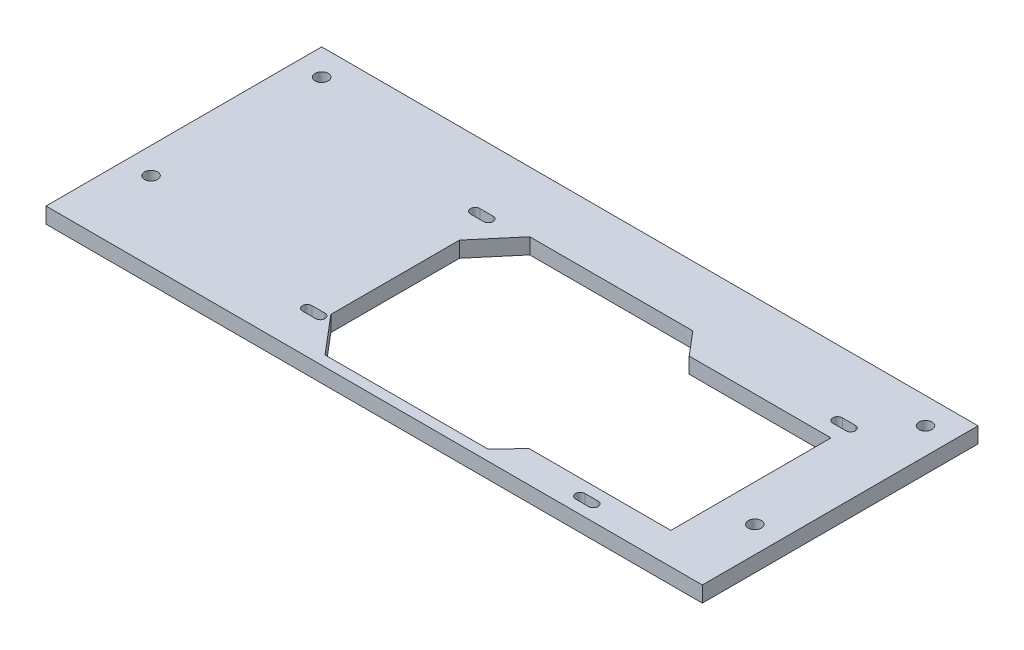
ISO-10303-21;
HEADER;
FILE_DESCRIPTION(('STEP AP214'),'2;1');
FILE_NAME('part.step','',(''),(''),'','','');
FILE_SCHEMA(('AUTOMOTIVE_DESIGN { 1 0 10303 214 1 1 1 1 }'));
ENDSEC;
DATA;
#1=APPLICATION_CONTEXT('core data for automotive mechanical design processes');
#2=APPLICATION_PROTOCOL_DEFINITION('international standard','automotive_design',2000,#1);
#3=PRODUCT_CONTEXT('',#1,'mechanical');
#4=PRODUCT('Part','Part','',(#3));
#5=PRODUCT_RELATED_PRODUCT_CATEGORY('part','',(#4));
#6=PRODUCT_DEFINITION_FORMATION('','',#4);
#7=PRODUCT_DEFINITION_CONTEXT('part definition',#1,'design');
#8=PRODUCT_DEFINITION('design','',#6,#7);
#9=PRODUCT_DEFINITION_SHAPE('','',#8);
#10=(LENGTH_UNIT() NAMED_UNIT(*) SI_UNIT(.MILLI.,.METRE.));
#11=(NAMED_UNIT(*) PLANE_ANGLE_UNIT() SI_UNIT($,.RADIAN.));
#12=(NAMED_UNIT(*) SI_UNIT($,.STERADIAN.) SOLID_ANGLE_UNIT());
#13=UNCERTAINTY_MEASURE_WITH_UNIT(LENGTH_MEASURE(1.E-05),#10,'distance_accuracy_value','');
#14=(GEOMETRIC_REPRESENTATION_CONTEXT(3) GLOBAL_UNCERTAINTY_ASSIGNED_CONTEXT((#13)) GLOBAL_UNIT_ASSIGNED_CONTEXT((#10,
#11,#12)) REPRESENTATION_CONTEXT('',''));
#15=CARTESIAN_POINT('',(0.,0.,0.));
#16=DIRECTION('',(0.,0.,1.));
#17=DIRECTION('',(1.,0.,0.));
#18=AXIS2_PLACEMENT_3D('',#15,#16,#17);
#19=CARTESIAN_POINT('',(-125.,6.,52.5));
#20=DIRECTION('',(-1.,0.,0.));
#21=DIRECTION('',(0.,0.,1.));
#22=AXIS2_PLACEMENT_3D('',#19,#20,#21);
#23=PLANE('',#22);
#24=DIRECTION('',(0.,0.,-1.));
#25=VECTOR('',#24,1.);
#26=CARTESIAN_POINT('',(-125.,0.,52.5));
#27=LINE('',#26,#25);
#28=CARTESIAN_POINT('',(-125.,0.,52.5));
#29=VERTEX_POINT('',#28);
#30=CARTESIAN_POINT('',(-125.,0.,-52.5));
#31=VERTEX_POINT('',#30);
#32=EDGE_CURVE('E626',#29,#31,#27,.T.);
#33=ORIENTED_EDGE('',*,*,#32,.F.);
#34=DIRECTION('',(0.,-1.,0.));
#35=VECTOR('',#34,1.);
#36=CARTESIAN_POINT('',(-125.,6.,52.5));
#37=LINE('',#36,#35);
#38=CARTESIAN_POINT('',(-125.,6.,52.5));
#39=VERTEX_POINT('',#38);
#40=EDGE_CURVE('E12',#39,#29,#37,.T.);
#41=ORIENTED_EDGE('',*,*,#40,.F.);
#42=DIRECTION('',(0.,0.,-1.));
#43=VECTOR('',#42,1.);
#44=CARTESIAN_POINT('',(-125.,6.,52.5));
#45=LINE('',#44,#43);
#46=CARTESIAN_POINT('',(-125.,6.,-52.5));
#47=VERTEX_POINT('',#46);
#48=EDGE_CURVE('E629',#39,#47,#45,.T.);
#49=ORIENTED_EDGE('',*,*,#48,.T.);
#50=DIRECTION('',(0.,-1.,0.));
#51=VECTOR('',#50,1.);
#52=CARTESIAN_POINT('',(-125.,6.,-52.5));
#53=LINE('',#52,#51);
#54=EDGE_CURVE('E203',#47,#31,#53,.T.);
#55=ORIENTED_EDGE('',*,*,#54,.T.);
#56=EDGE_LOOP('',(#33,#41,#49,#55));
#57=FACE_BOUND('',#56,.T.);
#58=ADVANCED_FACE('F200',(#57),#23,.T.);
#59=CARTESIAN_POINT('',(-125.,6.,52.5));
#60=DIRECTION('',(0.,0.,-1.));
#61=DIRECTION('',(-1.,0.,0.));
#62=AXIS2_PLACEMENT_3D('',#59,#60,#61);
#63=PLANE('',#62);
#64=DIRECTION('',(1.,0.,0.));
#65=VECTOR('',#64,1.);
#66=CARTESIAN_POINT('',(-125.,0.,52.5));
#67=LINE('',#66,#65);
#68=CARTESIAN_POINT('',(125.,0.,52.5));
#69=VERTEX_POINT('',#68);
#70=EDGE_CURVE('E633',#29,#69,#67,.T.);
#71=ORIENTED_EDGE('',*,*,#70,.T.);
#72=DIRECTION('',(0.,-1.,0.));
#73=VECTOR('',#72,1.);
#74=CARTESIAN_POINT('',(125.,6.,52.5));
#75=LINE('',#74,#73);
#76=CARTESIAN_POINT('',(125.,6.,52.5));
#77=VERTEX_POINT('',#76);
#78=EDGE_CURVE('E208',#77,#69,#75,.T.);
#79=ORIENTED_EDGE('',*,*,#78,.F.);
#80=DIRECTION('',(1.,0.,0.));
#81=VECTOR('',#80,1.);
#82=CARTESIAN_POINT('',(-125.,6.,52.5));
#83=LINE('',#82,#81);
#84=EDGE_CURVE('E638',#39,#77,#83,.T.);
#85=ORIENTED_EDGE('',*,*,#84,.F.);
#86=ORIENTED_EDGE('',*,*,#40,.T.);
#87=EDGE_LOOP('',(#71,#79,#85,#86));
#88=FACE_BOUND('',#87,.T.);
#89=ADVANCED_FACE('F664',(#88),#63,.F.);
#90=CARTESIAN_POINT('',(125.,6.,52.5));
#91=DIRECTION('',(-1.,0.,0.));
#92=DIRECTION('',(0.,0.,1.));
#93=AXIS2_PLACEMENT_3D('',#90,#91,#92);
#94=PLANE('',#93);
#95=DIRECTION('',(0.,0.,-1.));
#96=VECTOR('',#95,1.);
#97=CARTESIAN_POINT('',(125.,0.,52.5));
#98=LINE('',#97,#96);
#99=CARTESIAN_POINT('',(125.,0.,-52.5));
#100=VERTEX_POINT('',#99);
#101=EDGE_CURVE('E645',#69,#100,#98,.T.);
#102=ORIENTED_EDGE('',*,*,#101,.T.);
#103=DIRECTION('',(0.,-1.,0.));
#104=VECTOR('',#103,1.);
#105=CARTESIAN_POINT('',(125.,6.,-52.5));
#106=LINE('',#105,#104);
#107=CARTESIAN_POINT('',(125.,6.,-52.5));
#108=VERTEX_POINT('',#107);
#109=EDGE_CURVE('E650',#108,#100,#106,.T.);
#110=ORIENTED_EDGE('',*,*,#109,.F.);
#111=DIRECTION('',(0.,0.,-1.));
#112=VECTOR('',#111,1.);
#113=CARTESIAN_POINT('',(125.,6.,52.5));
#114=LINE('',#113,#112);
#115=EDGE_CURVE('E636',#77,#108,#114,.T.);
#116=ORIENTED_EDGE('',*,*,#115,.F.);
#117=ORIENTED_EDGE('',*,*,#78,.T.);
#118=EDGE_LOOP('',(#102,#110,#116,#117));
#119=FACE_BOUND('',#118,.T.);
#120=ADVANCED_FACE('F668',(#119),#94,.F.);
#121=CARTESIAN_POINT('',(-125.,6.,-52.5));
#122=DIRECTION('',(0.,0.,-1.));
#123=DIRECTION('',(-1.,0.,0.));
#124=AXIS2_PLACEMENT_3D('',#121,#122,#123);
#125=PLANE('',#124);
#126=DIRECTION('',(1.,0.,0.));
#127=VECTOR('',#126,1.);
#128=CARTESIAN_POINT('',(-125.,0.,-52.5));
#129=LINE('',#128,#127);
#130=EDGE_CURVE('E642',#31,#100,#129,.T.);
#131=ORIENTED_EDGE('',*,*,#130,.F.);
#132=ORIENTED_EDGE('',*,*,#54,.F.);
#133=DIRECTION('',(1.,0.,0.));
#134=VECTOR('',#133,1.);
#135=CARTESIAN_POINT('',(-125.,6.,-52.5));
#136=LINE('',#135,#134);
#137=EDGE_CURVE('E632',#47,#108,#136,.T.);
#138=ORIENTED_EDGE('',*,*,#137,.T.);
#139=ORIENTED_EDGE('',*,*,#109,.T.);
#140=EDGE_LOOP('',(#131,#132,#138,#139));
#141=FACE_BOUND('',#140,.T.);
#142=ADVANCED_FACE('F658',(#141),#125,.T.);
#143=CARTESIAN_POINT('',(0.,6.,0.));
#144=DIRECTION('',(0.,-1.,0.));
#145=DIRECTION('',(0.,0.,-1.));
#146=AXIS2_PLACEMENT_3D('',#143,#144,#145);
#147=PLANE('',#146);
#148=CARTESIAN_POINT('',(72.5,6.,46.5));
#149=DIRECTION('',(0.,1.,0.));
#150=DIRECTION('',(0.,0.,1.));
#151=AXIS2_PLACEMENT_3D('',#148,#149,#150);
#152=CIRCLE('',#151,1.8);
#153=CARTESIAN_POINT('',(72.5,6.,44.7));
#154=VERTEX_POINT('',#153);
#155=CARTESIAN_POINT('',(72.5,6.,48.3));
#156=VERTEX_POINT('',#155);
#157=EDGE_CURVE('E425',#154,#156,#152,.T.);
#158=ORIENTED_EDGE('',*,*,#157,.F.);
#159=DIRECTION('',(1.,0.,0.));
#160=VECTOR('',#159,1.);
#161=CARTESIAN_POINT('',(72.5,6.,44.7));
#162=LINE('',#161,#160);
#163=CARTESIAN_POINT('',(77.5,6.,44.7));
#164=VERTEX_POINT('',#163);
#165=EDGE_CURVE('E400',#154,#164,#162,.T.);
#166=ORIENTED_EDGE('',*,*,#165,.T.);
#167=CARTESIAN_POINT('',(77.5,6.,46.5));
#168=DIRECTION('',(0.,-1.,0.));
#169=DIRECTION('',(0.,0.,-1.));
#170=AXIS2_PLACEMENT_3D('',#167,#168,#169);
#171=CIRCLE('',#170,1.8);
#172=CARTESIAN_POINT('',(77.5,6.,48.3));
#173=VERTEX_POINT('',#172);
#174=EDGE_CURVE('E430',#164,#173,#171,.T.);
#175=ORIENTED_EDGE('',*,*,#174,.T.);
#176=DIRECTION('',(1.,0.,0.));
#177=VECTOR('',#176,1.);
#178=CARTESIAN_POINT('',(72.5,6.,48.3));
#179=LINE('',#178,#177);
#180=EDGE_CURVE('E427',#156,#173,#179,.T.);
#181=ORIENTED_EDGE('',*,*,#180,.F.);
#182=EDGE_LOOP('',(#158,#166,#175,#181));
#183=FACE_BOUND('',#182,.T.);
#184=CARTESIAN_POINT('',(96.5,6.,-27.5));
#185=DIRECTION('',(0.,1.,0.));
#186=DIRECTION('',(0.,0.,1.));
#187=AXIS2_PLACEMENT_3D('',#184,#185,#186);
#188=CIRCLE('',#187,1.8);
#189=CARTESIAN_POINT('',(96.5,6.,-29.3));
#190=VERTEX_POINT('',#189);
#191=CARTESIAN_POINT('',(96.5,6.,-25.7));
#192=VERTEX_POINT('',#191);
#193=EDGE_CURVE('E437',#190,#192,#188,.T.);
#194=ORIENTED_EDGE('',*,*,#193,.F.);
#195=DIRECTION('',(1.,0.,0.));
#196=VECTOR('',#195,1.);
#197=CARTESIAN_POINT('',(96.5,6.,-29.3));
#198=LINE('',#197,#196);
#199=CARTESIAN_POINT('',(101.5,6.,-29.3));
#200=VERTEX_POINT('',#199);
#201=EDGE_CURVE('E445',#190,#200,#198,.T.);
#202=ORIENTED_EDGE('',*,*,#201,.T.);
#203=CARTESIAN_POINT('',(101.5,6.,-27.5));
#204=DIRECTION('',(0.,-1.,0.));
#205=DIRECTION('',(0.,0.,-1.));
#206=AXIS2_PLACEMENT_3D('',#203,#204,#205);
#207=CIRCLE('',#206,1.8);
#208=CARTESIAN_POINT('',(101.5,6.,-25.7));
#209=VERTEX_POINT('',#208);
#210=EDGE_CURVE('E458',#200,#209,#207,.T.);
#211=ORIENTED_EDGE('',*,*,#210,.T.);
#212=DIRECTION('',(1.,0.,0.));
#213=VECTOR('',#212,1.);
#214=CARTESIAN_POINT('',(96.5,6.,-25.7));
#215=LINE('',#214,#213);
#216=EDGE_CURVE('E455',#192,#209,#215,.T.);
#217=ORIENTED_EDGE('',*,*,#216,.F.);
#218=EDGE_LOOP('',(#194,#202,#211,#217));
#219=FACE_BOUND('',#218,.T.);
#220=CARTESIAN_POINT('',(-41.5,6.,-27.5));
#221=DIRECTION('',(0.,1.,0.));
#222=DIRECTION('',(0.,0.,1.));
#223=AXIS2_PLACEMENT_3D('',#220,#221,#222);
#224=CIRCLE('',#223,1.8);
#225=CARTESIAN_POINT('',(-41.5,6.,-29.3));
#226=VERTEX_POINT('',#225);
#227=CARTESIAN_POINT('',(-41.5,6.,-25.7));
#228=VERTEX_POINT('',#227);
#229=EDGE_CURVE('E466',#226,#228,#224,.T.);
#230=ORIENTED_EDGE('',*,*,#229,.F.);
#231=DIRECTION('',(1.,0.,0.));
#232=VECTOR('',#231,1.);
#233=CARTESIAN_POINT('',(-41.5,6.,-29.3));
#234=LINE('',#233,#232);
#235=CARTESIAN_POINT('',(-36.5,6.,-29.3));
#236=VERTEX_POINT('',#235);
#237=EDGE_CURVE('E476',#226,#236,#234,.T.);
#238=ORIENTED_EDGE('',*,*,#237,.T.);
#239=CARTESIAN_POINT('',(-36.5,6.,-27.5));
#240=DIRECTION('',(0.,-1.,0.));
#241=DIRECTION('',(0.,0.,-1.));
#242=AXIS2_PLACEMENT_3D('',#239,#240,#241);
#243=CIRCLE('',#242,1.8);
#244=CARTESIAN_POINT('',(-36.5,6.,-25.7));
#245=VERTEX_POINT('',#244);
#246=EDGE_CURVE('E489',#236,#245,#243,.T.);
#247=ORIENTED_EDGE('',*,*,#246,.T.);
#248=DIRECTION('',(1.,0.,0.));
#249=VECTOR('',#248,1.);
#250=CARTESIAN_POINT('',(-41.5,6.,-25.7));
#251=LINE('',#250,#249);
#252=EDGE_CURVE('E486',#228,#245,#251,.T.);
#253=ORIENTED_EDGE('',*,*,#252,.F.);
#254=EDGE_LOOP('',(#230,#238,#247,#253));
#255=FACE_BOUND('',#254,.T.);
#256=CARTESIAN_POINT('',(-41.5,6.,36.5));
#257=DIRECTION('',(0.,1.,0.));
#258=DIRECTION('',(0.,0.,1.));
#259=AXIS2_PLACEMENT_3D('',#256,#257,#258);
#260=CIRCLE('',#259,1.8);
#261=CARTESIAN_POINT('',(-41.5,6.,34.7));
#262=VERTEX_POINT('',#261);
#263=CARTESIAN_POINT('',(-41.5,6.,38.3));
#264=VERTEX_POINT('',#263);
#265=EDGE_CURVE('E497',#262,#264,#260,.T.);
#266=ORIENTED_EDGE('',*,*,#265,.F.);
#267=DIRECTION('',(1.,0.,0.));
#268=VECTOR('',#267,1.);
#269=CARTESIAN_POINT('',(-41.5,6.,34.7));
#270=LINE('',#269,#268);
#271=CARTESIAN_POINT('',(-36.5,6.,34.7));
#272=VERTEX_POINT('',#271);
#273=EDGE_CURVE('E507',#262,#272,#270,.T.);
#274=ORIENTED_EDGE('',*,*,#273,.T.);
#275=CARTESIAN_POINT('',(-36.5,6.,36.5));
#276=DIRECTION('',(0.,-1.,0.));
#277=DIRECTION('',(0.,0.,-1.));
#278=AXIS2_PLACEMENT_3D('',#275,#276,#277);
#279=CIRCLE('',#278,1.79999999999999);
#280=CARTESIAN_POINT('',(-36.5,6.,38.3));
#281=VERTEX_POINT('',#280);
#282=EDGE_CURVE('E520',#272,#281,#279,.T.);
#283=ORIENTED_EDGE('',*,*,#282,.T.);
#284=DIRECTION('',(1.,0.,0.));
#285=VECTOR('',#284,1.);
#286=CARTESIAN_POINT('',(-41.5,6.,38.3));
#287=LINE('',#286,#285);
#288=EDGE_CURVE('E517',#264,#281,#287,.T.);
#289=ORIENTED_EDGE('',*,*,#288,.F.);
#290=EDGE_LOOP('',(#266,#274,#283,#289));
#291=FACE_BOUND('',#290,.T.);
#292=DIRECTION('',(-1.,0.,0.));
#293=VECTOR('',#292,1.);
#294=CARTESIAN_POINT('',(39.3831747919144,6.,48.5));
#295=LINE('',#294,#293);
#296=CARTESIAN_POINT('',(39.3831747919144,6.,48.5));
#297=VERTEX_POINT('',#296);
#298=CARTESIAN_POINT('',(-22.7284482758621,6.,48.5));
#299=VERTEX_POINT('',#298);
#300=EDGE_CURVE('E528',#297,#299,#295,.T.);
#301=ORIENTED_EDGE('',*,*,#300,.T.);
#302=DIRECTION('',(-0.646013441523527,0.,-0.763326033468615));
#303=VECTOR('',#302,1.);
#304=CARTESIAN_POINT('',(-22.7284482758621,6.,48.5));
#305=LINE('',#304,#303);
#306=CARTESIAN_POINT('',(-35.,6.,34.));
#307=VERTEX_POINT('',#306);
#308=EDGE_CURVE('E550',#299,#307,#305,.T.);
#309=ORIENTED_EDGE('',*,*,#308,.T.);
#310=DIRECTION('',(0.,0.,-1.));
#311=VECTOR('',#310,1.);
#312=CARTESIAN_POINT('',(-35.,6.,34.));
#313=LINE('',#312,#311);
#314=CARTESIAN_POINT('',(-35.,6.,-15.));
#315=VERTEX_POINT('',#314);
#316=EDGE_CURVE('E600',#307,#315,#313,.T.);
#317=ORIENTED_EDGE('',*,*,#316,.T.);
#318=DIRECTION('',(0.646013441523527,0.,-0.763326033468615));
#319=VECTOR('',#318,1.);
#320=CARTESIAN_POINT('',(-35.,6.,-15.));
#321=LINE('',#320,#319);
#322=CARTESIAN_POINT('',(-22.7284482758621,6.,-29.5));
#323=VERTEX_POINT('',#322);
#324=EDGE_CURVE('E597',#315,#323,#321,.T.);
#325=ORIENTED_EDGE('',*,*,#324,.T.);
#326=DIRECTION('',(1.,0.,0.));
#327=VECTOR('',#326,1.);
#328=CARTESIAN_POINT('',(-22.7284482758621,6.,-29.5));
#329=LINE('',#328,#327);
#330=CARTESIAN_POINT('',(39.3831747919144,6.,-29.5));
#331=VERTEX_POINT('',#330);
#332=EDGE_CURVE('E594',#323,#331,#329,.T.);
#333=ORIENTED_EDGE('',*,*,#332,.T.);
#334=DIRECTION('',(0.646013441523526,0.,0.763326033468616));
#335=VECTOR('',#334,1.);
#336=CARTESIAN_POINT('',(39.3831747919144,6.,-29.5));
#337=LINE('',#336,#335);
#338=CARTESIAN_POINT('',(47.,6.,-20.5));
#339=VERTEX_POINT('',#338);
#340=EDGE_CURVE('E591',#331,#339,#337,.T.);
#341=ORIENTED_EDGE('',*,*,#340,.T.);
#342=DIRECTION('',(1.,0.,0.));
#343=VECTOR('',#342,1.);
#344=CARTESIAN_POINT('',(47.,6.,-20.5));
#345=LINE('',#344,#343);
#346=CARTESIAN_POINT('',(101.,6.,-20.5));
#347=VERTEX_POINT('',#346);
#348=EDGE_CURVE('E588',#339,#347,#345,.T.);
#349=ORIENTED_EDGE('',*,*,#348,.T.);
#350=DIRECTION('',(0.,0.,1.));
#351=VECTOR('',#350,1.);
#352=CARTESIAN_POINT('',(101.,6.,-20.5));
#353=LINE('',#352,#351);
#354=CARTESIAN_POINT('',(101.,6.,40.5));
#355=VERTEX_POINT('',#354);
#356=EDGE_CURVE('E585',#347,#355,#353,.T.);
#357=ORIENTED_EDGE('',*,*,#356,.T.);
#358=DIRECTION('',(-1.,0.,0.));
#359=VECTOR('',#358,1.);
#360=CARTESIAN_POINT('',(101.,6.,40.5));
#361=LINE('',#360,#359);
#362=CARTESIAN_POINT('',(47.,6.,40.5));
#363=VERTEX_POINT('',#362);
#364=EDGE_CURVE('E582',#355,#363,#361,.T.);
#365=ORIENTED_EDGE('',*,*,#364,.T.);
#366=DIRECTION('',(-0.689549663620779,0.,0.724238400942998));
#367=VECTOR('',#366,1.);
#368=CARTESIAN_POINT('',(47.,6.,40.5));
#369=LINE('',#368,#367);
#370=EDGE_CURVE('E579',#363,#297,#369,.T.);
#371=ORIENTED_EDGE('',*,*,#370,.T.);
#372=EDGE_LOOP('',(#301,#309,#317,#325,#333,#341,#349,#357,#365,#371));
#373=FACE_BOUND('',#372,.T.);
#374=CARTESIAN_POINT('',(115.,6.,22.5));
#375=DIRECTION('',(0.,1.,0.));
#376=DIRECTION('',(0.,0.,1.));
#377=AXIS2_PLACEMENT_3D('',#374,#375,#376);
#378=CIRCLE('',#377,2.50000000000001);
#379=CARTESIAN_POINT('',(115.,6.,25.));
#380=VERTEX_POINT('',#379);
#381=EDGE_CURVE('E576',#380,#380,#378,.T.);
#382=ORIENTED_EDGE('',*,*,#381,.F.);
#383=EDGE_LOOP('',(#382));
#384=FACE_BOUND('',#383,.T.);
#385=CARTESIAN_POINT('',(115.,6.,-42.5));
#386=DIRECTION('',(0.,1.,0.));
#387=DIRECTION('',(0.,0.,1.));
#388=AXIS2_PLACEMENT_3D('',#385,#386,#387);
#389=CIRCLE('',#388,2.50000000000001);
#390=CARTESIAN_POINT('',(115.,6.,-40.));
#391=VERTEX_POINT('',#390);
#392=EDGE_CURVE('E608',#391,#391,#389,.T.);
#393=ORIENTED_EDGE('',*,*,#392,.F.);
#394=EDGE_LOOP('',(#393));
#395=FACE_BOUND('',#394,.T.);
#396=CARTESIAN_POINT('',(-115.,6.,-42.5));
#397=DIRECTION('',(0.,1.,0.));
#398=DIRECTION('',(0.,0.,1.));
#399=AXIS2_PLACEMENT_3D('',#396,#397,#398);
#400=CIRCLE('',#399,2.50000000000001);
#401=CARTESIAN_POINT('',(-115.,6.,-40.));
#402=VERTEX_POINT('',#401);
#403=EDGE_CURVE('E614',#402,#402,#400,.T.);
#404=ORIENTED_EDGE('',*,*,#403,.F.);
#405=EDGE_LOOP('',(#404));
#406=FACE_BOUND('',#405,.T.);
#407=CARTESIAN_POINT('',(-115.,6.,22.5));
#408=DIRECTION('',(0.,1.,0.));
#409=DIRECTION('',(0.,0.,1.));
#410=AXIS2_PLACEMENT_3D('',#407,#408,#409);
#411=CIRCLE('',#410,2.50000000000001);
#412=CARTESIAN_POINT('',(-115.,6.,25.));
#413=VERTEX_POINT('',#412);
#414=EDGE_CURVE('E623',#413,#413,#411,.T.);
#415=ORIENTED_EDGE('',*,*,#414,.F.);
#416=EDGE_LOOP('',(#415));
#417=FACE_BOUND('',#416,.T.);
#418=ORIENTED_EDGE('',*,*,#48,.F.);
#419=ORIENTED_EDGE('',*,*,#84,.T.);
#420=ORIENTED_EDGE('',*,*,#115,.T.);
#421=ORIENTED_EDGE('',*,*,#137,.F.);
#422=EDGE_LOOP('',(#418,#419,#420,#421));
#423=FACE_BOUND('',#422,.T.);
#424=ADVANCED_FACE('F670',(#183,#219,#255,#291,#373,#384,#395,#406,#417,#423),#147,.F.);
#425=CARTESIAN_POINT('',(0.,0.,0.));
#426=DIRECTION('',(0.,-1.,0.));
#427=DIRECTION('',(0.,0.,-1.));
#428=AXIS2_PLACEMENT_3D('',#425,#426,#427);
#429=PLANE('',#428);
#430=DIRECTION('',(1.,0.,0.));
#431=VECTOR('',#430,1.);
#432=CARTESIAN_POINT('',(72.5,0.,44.7));
#433=LINE('',#432,#431);
#434=CARTESIAN_POINT('',(72.5,0.,44.7));
#435=VERTEX_POINT('',#434);
#436=CARTESIAN_POINT('',(77.5,0.,44.7));
#437=VERTEX_POINT('',#436);
#438=EDGE_CURVE('E224',#435,#437,#433,.T.);
#439=ORIENTED_EDGE('',*,*,#438,.F.);
#440=CARTESIAN_POINT('',(72.5,0.,46.5));
#441=DIRECTION('',(0.,1.,0.));
#442=DIRECTION('',(0.,0.,1.));
#443=AXIS2_PLACEMENT_3D('',#440,#441,#442);
#444=CIRCLE('',#443,1.8);
#445=CARTESIAN_POINT('',(72.5,0.,48.3));
#446=VERTEX_POINT('',#445);
#447=EDGE_CURVE('E406',#435,#446,#444,.T.);
#448=ORIENTED_EDGE('',*,*,#447,.T.);
#449=DIRECTION('',(1.,0.,0.));
#450=VECTOR('',#449,1.);
#451=CARTESIAN_POINT('',(72.5,0.,48.3));
#452=LINE('',#451,#450);
#453=CARTESIAN_POINT('',(77.5,0.,48.3));
#454=VERTEX_POINT('',#453);
#455=EDGE_CURVE('E412',#446,#454,#452,.T.);
#456=ORIENTED_EDGE('',*,*,#455,.T.);
#457=CARTESIAN_POINT('',(77.5,0.,46.5));
#458=DIRECTION('',(0.,-1.,0.));
#459=DIRECTION('',(0.,0.,-1.));
#460=AXIS2_PLACEMENT_3D('',#457,#458,#459);
#461=CIRCLE('',#460,1.8);
#462=EDGE_CURVE('E417',#437,#454,#461,.T.);
#463=ORIENTED_EDGE('',*,*,#462,.F.);
#464=EDGE_LOOP('',(#439,#448,#456,#463));
#465=FACE_BOUND('',#464,.T.);
#466=DIRECTION('',(1.,0.,0.));
#467=VECTOR('',#466,1.);
#468=CARTESIAN_POINT('',(96.5,0.,-29.3));
#469=LINE('',#468,#467);
#470=CARTESIAN_POINT('',(96.5,0.,-29.3));
#471=VERTEX_POINT('',#470);
#472=CARTESIAN_POINT('',(101.5,0.,-29.3));
#473=VERTEX_POINT('',#472);
#474=EDGE_CURVE('E451',#471,#473,#469,.T.);
#475=ORIENTED_EDGE('',*,*,#474,.F.);
#476=CARTESIAN_POINT('',(96.5,0.,-27.5));
#477=DIRECTION('',(0.,1.,0.));
#478=DIRECTION('',(0.,0.,1.));
#479=AXIS2_PLACEMENT_3D('',#476,#477,#478);
#480=CIRCLE('',#479,1.8);
#481=CARTESIAN_POINT('',(96.5,0.,-25.7));
#482=VERTEX_POINT('',#481);
#483=EDGE_CURVE('E441',#471,#482,#480,.T.);
#484=ORIENTED_EDGE('',*,*,#483,.T.);
#485=DIRECTION('',(1.,0.,0.));
#486=VECTOR('',#485,1.);
#487=CARTESIAN_POINT('',(96.5,0.,-25.7));
#488=LINE('',#487,#486);
#489=CARTESIAN_POINT('',(101.5,0.,-25.7));
#490=VERTEX_POINT('',#489);
#491=EDGE_CURVE('E444',#482,#490,#488,.T.);
#492=ORIENTED_EDGE('',*,*,#491,.T.);
#493=CARTESIAN_POINT('',(101.5,0.,-27.5));
#494=DIRECTION('',(0.,-1.,0.));
#495=DIRECTION('',(0.,0.,-1.));
#496=AXIS2_PLACEMENT_3D('',#493,#494,#495);
#497=CIRCLE('',#496,1.8);
#498=EDGE_CURVE('E448',#473,#490,#497,.T.);
#499=ORIENTED_EDGE('',*,*,#498,.F.);
#500=EDGE_LOOP('',(#475,#484,#492,#499));
#501=FACE_BOUND('',#500,.T.);
#502=DIRECTION('',(1.,0.,0.));
#503=VECTOR('',#502,1.);
#504=CARTESIAN_POINT('',(-41.5,0.,-29.3));
#505=LINE('',#504,#503);
#506=CARTESIAN_POINT('',(-41.5,0.,-29.3));
#507=VERTEX_POINT('',#506);
#508=CARTESIAN_POINT('',(-36.5,0.,-29.3));
#509=VERTEX_POINT('',#508);
#510=EDGE_CURVE('E482',#507,#509,#505,.T.);
#511=ORIENTED_EDGE('',*,*,#510,.F.);
#512=CARTESIAN_POINT('',(-41.5,0.,-27.5));
#513=DIRECTION('',(0.,1.,0.));
#514=DIRECTION('',(0.,0.,1.));
#515=AXIS2_PLACEMENT_3D('',#512,#513,#514);
#516=CIRCLE('',#515,1.8);
#517=CARTESIAN_POINT('',(-41.5,0.,-25.7));
#518=VERTEX_POINT('',#517);
#519=EDGE_CURVE('E472',#507,#518,#516,.T.);
#520=ORIENTED_EDGE('',*,*,#519,.T.);
#521=DIRECTION('',(1.,0.,0.));
#522=VECTOR('',#521,1.);
#523=CARTESIAN_POINT('',(-41.5,0.,-25.7));
#524=LINE('',#523,#522);
#525=CARTESIAN_POINT('',(-36.5,0.,-25.7));
#526=VERTEX_POINT('',#525);
#527=EDGE_CURVE('E475',#518,#526,#524,.T.);
#528=ORIENTED_EDGE('',*,*,#527,.T.);
#529=CARTESIAN_POINT('',(-36.5,0.,-27.5));
#530=DIRECTION('',(0.,-1.,0.));
#531=DIRECTION('',(0.,0.,-1.));
#532=AXIS2_PLACEMENT_3D('',#529,#530,#531);
#533=CIRCLE('',#532,1.8);
#534=EDGE_CURVE('E479',#509,#526,#533,.T.);
#535=ORIENTED_EDGE('',*,*,#534,.F.);
#536=EDGE_LOOP('',(#511,#520,#528,#535));
#537=FACE_BOUND('',#536,.T.);
#538=DIRECTION('',(1.,0.,0.));
#539=VECTOR('',#538,1.);
#540=CARTESIAN_POINT('',(-41.5,0.,34.7));
#541=LINE('',#540,#539);
#542=CARTESIAN_POINT('',(-41.5,0.,34.7));
#543=VERTEX_POINT('',#542);
#544=CARTESIAN_POINT('',(-36.5,0.,34.7));
#545=VERTEX_POINT('',#544);
#546=EDGE_CURVE('E513',#543,#545,#541,.T.);
#547=ORIENTED_EDGE('',*,*,#546,.F.);
#548=CARTESIAN_POINT('',(-41.5,0.,36.5));
#549=DIRECTION('',(0.,1.,0.));
#550=DIRECTION('',(0.,0.,1.));
#551=AXIS2_PLACEMENT_3D('',#548,#549,#550);
#552=CIRCLE('',#551,1.8);
#553=CARTESIAN_POINT('',(-41.5,0.,38.3));
#554=VERTEX_POINT('',#553);
#555=EDGE_CURVE('E503',#543,#554,#552,.T.);
#556=ORIENTED_EDGE('',*,*,#555,.T.);
#557=DIRECTION('',(1.,0.,0.));
#558=VECTOR('',#557,1.);
#559=CARTESIAN_POINT('',(-41.5,0.,38.3));
#560=LINE('',#559,#558);
#561=CARTESIAN_POINT('',(-36.5,0.,38.3));
#562=VERTEX_POINT('',#561);
#563=EDGE_CURVE('E506',#554,#562,#560,.T.);
#564=ORIENTED_EDGE('',*,*,#563,.T.);
#565=CARTESIAN_POINT('',(-36.5,0.,36.5));
#566=DIRECTION('',(0.,-1.,0.));
#567=DIRECTION('',(0.,0.,-1.));
#568=AXIS2_PLACEMENT_3D('',#565,#566,#567);
#569=CIRCLE('',#568,1.79999999999999);
#570=EDGE_CURVE('E510',#545,#562,#569,.T.);
#571=ORIENTED_EDGE('',*,*,#570,.F.);
#572=EDGE_LOOP('',(#547,#556,#564,#571));
#573=FACE_BOUND('',#572,.T.);
#574=DIRECTION('',(-0.646013441523527,0.,-0.763326033468615));
#575=VECTOR('',#574,1.);
#576=CARTESIAN_POINT('',(-22.7284482758621,0.,48.5));
#577=LINE('',#576,#575);
#578=CARTESIAN_POINT('',(-22.7284482758621,0.,48.5));
#579=VERTEX_POINT('',#578);
#580=CARTESIAN_POINT('',(-35.,0.,34.));
#581=VERTEX_POINT('',#580);
#582=EDGE_CURVE('E574',#579,#581,#577,.T.);
#583=ORIENTED_EDGE('',*,*,#582,.F.);
#584=DIRECTION('',(-1.,0.,0.));
#585=VECTOR('',#584,1.);
#586=CARTESIAN_POINT('',(39.3831747919144,0.,48.5));
#587=LINE('',#586,#585);
#588=CARTESIAN_POINT('',(39.3831747919144,0.,48.5));
#589=VERTEX_POINT('',#588);
#590=EDGE_CURVE('E546',#589,#579,#587,.T.);
#591=ORIENTED_EDGE('',*,*,#590,.F.);
#592=DIRECTION('',(-0.689549663620779,0.,0.724238400942998));
#593=VECTOR('',#592,1.);
#594=CARTESIAN_POINT('',(47.,0.,40.5));
#595=LINE('',#594,#593);
#596=CARTESIAN_POINT('',(47.,0.,40.5));
#597=VERTEX_POINT('',#596);
#598=EDGE_CURVE('E549',#597,#589,#595,.T.);
#599=ORIENTED_EDGE('',*,*,#598,.F.);
#600=DIRECTION('',(-1.,0.,0.));
#601=VECTOR('',#600,1.);
#602=CARTESIAN_POINT('',(101.,0.,40.5));
#603=LINE('',#602,#601);
#604=CARTESIAN_POINT('',(101.,0.,40.5));
#605=VERTEX_POINT('',#604);
#606=EDGE_CURVE('E553',#605,#597,#603,.T.);
#607=ORIENTED_EDGE('',*,*,#606,.F.);
#608=DIRECTION('',(0.,0.,1.));
#609=VECTOR('',#608,1.);
#610=CARTESIAN_POINT('',(101.,0.,-20.5));
#611=LINE('',#610,#609);
#612=CARTESIAN_POINT('',(101.,0.,-20.5));
#613=VERTEX_POINT('',#612);
#614=EDGE_CURVE('E556',#613,#605,#611,.T.);
#615=ORIENTED_EDGE('',*,*,#614,.F.);
#616=DIRECTION('',(1.,0.,0.));
#617=VECTOR('',#616,1.);
#618=CARTESIAN_POINT('',(47.,0.,-20.5));
#619=LINE('',#618,#617);
#620=CARTESIAN_POINT('',(47.,0.,-20.5));
#621=VERTEX_POINT('',#620);
#622=EDGE_CURVE('E559',#621,#613,#619,.T.);
#623=ORIENTED_EDGE('',*,*,#622,.F.);
#624=DIRECTION('',(0.646013441523526,0.,0.763326033468616));
#625=VECTOR('',#624,1.);
#626=CARTESIAN_POINT('',(39.3831747919144,0.,-29.5));
#627=LINE('',#626,#625);
#628=CARTESIAN_POINT('',(39.3831747919144,0.,-29.5));
#629=VERTEX_POINT('',#628);
#630=EDGE_CURVE('E562',#629,#621,#627,.T.);
#631=ORIENTED_EDGE('',*,*,#630,.F.);
#632=DIRECTION('',(1.,0.,0.));
#633=VECTOR('',#632,1.);
#634=CARTESIAN_POINT('',(-22.7284482758621,0.,-29.5));
#635=LINE('',#634,#633);
#636=CARTESIAN_POINT('',(-22.7284482758621,0.,-29.5));
#637=VERTEX_POINT('',#636);
#638=EDGE_CURVE('E565',#637,#629,#635,.T.);
#639=ORIENTED_EDGE('',*,*,#638,.F.);
#640=DIRECTION('',(0.646013441523527,0.,-0.763326033468615));
#641=VECTOR('',#640,1.);
#642=CARTESIAN_POINT('',(-35.,0.,-15.));
#643=LINE('',#642,#641);
#644=CARTESIAN_POINT('',(-35.,0.,-15.));
#645=VERTEX_POINT('',#644);
#646=EDGE_CURVE('E568',#645,#637,#643,.T.);
#647=ORIENTED_EDGE('',*,*,#646,.F.);
#648=DIRECTION('',(0.,0.,-1.));
#649=VECTOR('',#648,1.);
#650=CARTESIAN_POINT('',(-35.,0.,34.));
#651=LINE('',#650,#649);
#652=EDGE_CURVE('E571',#581,#645,#651,.T.);
#653=ORIENTED_EDGE('',*,*,#652,.F.);
#654=EDGE_LOOP('',(#583,#591,#599,#607,#615,#623,#631,#639,#647,#653));
#655=FACE_BOUND('',#654,.T.);
#656=CARTESIAN_POINT('',(115.,0.,22.5));
#657=DIRECTION('',(0.,1.,0.));
#658=DIRECTION('',(0.,0.,1.));
#659=AXIS2_PLACEMENT_3D('',#656,#657,#658);
#660=CIRCLE('',#659,2.50000000000001);
#661=CARTESIAN_POINT('',(115.,0.,25.));
#662=VERTEX_POINT('',#661);
#663=EDGE_CURVE('E605',#662,#662,#660,.T.);
#664=ORIENTED_EDGE('',*,*,#663,.T.);
#665=EDGE_LOOP('',(#664));
#666=FACE_BOUND('',#665,.T.);
#667=CARTESIAN_POINT('',(115.,0.,-42.5));
#668=DIRECTION('',(0.,1.,0.));
#669=DIRECTION('',(0.,0.,1.));
#670=AXIS2_PLACEMENT_3D('',#667,#668,#669);
#671=CIRCLE('',#670,2.50000000000001);
#672=CARTESIAN_POINT('',(115.,0.,-40.));
#673=VERTEX_POINT('',#672);
#674=EDGE_CURVE('E611',#673,#673,#671,.T.);
#675=ORIENTED_EDGE('',*,*,#674,.T.);
#676=EDGE_LOOP('',(#675));
#677=FACE_BOUND('',#676,.T.);
#678=CARTESIAN_POINT('',(-115.,0.,-42.5));
#679=DIRECTION('',(0.,1.,0.));
#680=DIRECTION('',(0.,0.,1.));
#681=AXIS2_PLACEMENT_3D('',#678,#679,#680);
#682=CIRCLE('',#681,2.50000000000001);
#683=CARTESIAN_POINT('',(-115.,0.,-40.));
#684=VERTEX_POINT('',#683);
#685=EDGE_CURVE('E617',#684,#684,#682,.T.);
#686=ORIENTED_EDGE('',*,*,#685,.T.);
#687=EDGE_LOOP('',(#686));
#688=FACE_BOUND('',#687,.T.);
#689=CARTESIAN_POINT('',(-115.,0.,22.5));
#690=DIRECTION('',(0.,1.,0.));
#691=DIRECTION('',(0.,0.,1.));
#692=AXIS2_PLACEMENT_3D('',#689,#690,#691);
#693=CIRCLE('',#692,2.50000000000001);
#694=CARTESIAN_POINT('',(-115.,0.,25.));
#695=VERTEX_POINT('',#694);
#696=EDGE_CURVE('E620',#695,#695,#693,.T.);
#697=ORIENTED_EDGE('',*,*,#696,.T.);
#698=EDGE_LOOP('',(#697));
#699=FACE_BOUND('',#698,.T.);
#700=ORIENTED_EDGE('',*,*,#32,.T.);
#701=ORIENTED_EDGE('',*,*,#130,.T.);
#702=ORIENTED_EDGE('',*,*,#101,.F.);
#703=ORIENTED_EDGE('',*,*,#70,.F.);
#704=EDGE_LOOP('',(#700,#701,#702,#703));
#705=FACE_BOUND('',#704,.T.);
#706=ADVANCED_FACE('F415',(#465,#501,#537,#573,#655,#666,#677,#688,#699,#705),#429,.T.);
#707=CARTESIAN_POINT('',(-115.,6.,22.5));
#708=DIRECTION('',(0.,-1.,0.));
#709=DIRECTION('',(0.,0.,-1.));
#710=AXIS2_PLACEMENT_3D('',#707,#708,#709);
#711=CYLINDRICAL_SURFACE('',#710,2.50000000000001);
#712=ORIENTED_EDGE('',*,*,#414,.T.);
#713=EDGE_LOOP('',(#712));
#714=FACE_BOUND('',#713,.T.);
#715=ORIENTED_EDGE('',*,*,#696,.F.);
#716=EDGE_LOOP('',(#715));
#717=FACE_BOUND('',#716,.T.);
#718=ADVANCED_FACE('F678',(#714,#717),#711,.F.);
#719=CARTESIAN_POINT('',(-115.,6.,-42.5));
#720=DIRECTION('',(0.,-1.,0.));
#721=DIRECTION('',(0.,0.,-1.));
#722=AXIS2_PLACEMENT_3D('',#719,#720,#721);
#723=CYLINDRICAL_SURFACE('',#722,2.50000000000001);
#724=ORIENTED_EDGE('',*,*,#403,.T.);
#725=EDGE_LOOP('',(#724));
#726=FACE_BOUND('',#725,.T.);
#727=ORIENTED_EDGE('',*,*,#685,.F.);
#728=EDGE_LOOP('',(#727));
#729=FACE_BOUND('',#728,.T.);
#730=ADVANCED_FACE('F716',(#726,#729),#723,.F.);
#731=CARTESIAN_POINT('',(115.,6.,-42.5));
#732=DIRECTION('',(0.,-1.,0.));
#733=DIRECTION('',(0.,0.,-1.));
#734=AXIS2_PLACEMENT_3D('',#731,#732,#733);
#735=CYLINDRICAL_SURFACE('',#734,2.50000000000001);
#736=ORIENTED_EDGE('',*,*,#392,.T.);
#737=EDGE_LOOP('',(#736));
#738=FACE_BOUND('',#737,.T.);
#739=ORIENTED_EDGE('',*,*,#674,.F.);
#740=EDGE_LOOP('',(#739));
#741=FACE_BOUND('',#740,.T.);
#742=ADVANCED_FACE('F725',(#738,#741),#735,.F.);
#743=CARTESIAN_POINT('',(115.,6.,22.5));
#744=DIRECTION('',(0.,-1.,0.));
#745=DIRECTION('',(0.,0.,-1.));
#746=AXIS2_PLACEMENT_3D('',#743,#744,#745);
#747=CYLINDRICAL_SURFACE('',#746,2.50000000000001);
#748=ORIENTED_EDGE('',*,*,#381,.T.);
#749=EDGE_LOOP('',(#748));
#750=FACE_BOUND('',#749,.T.);
#751=ORIENTED_EDGE('',*,*,#663,.F.);
#752=EDGE_LOOP('',(#751));
#753=FACE_BOUND('',#752,.T.);
#754=ADVANCED_FACE('F735',(#750,#753),#747,.F.);
#755=CARTESIAN_POINT('',(-22.7284482758621,6.,48.5));
#756=DIRECTION('',(-0.763326033468615,0.,0.646013441523526));
#757=DIRECTION('',(0.646013441523527,0.,0.763326033468615));
#758=AXIS2_PLACEMENT_3D('',#755,#756,#757);
#759=PLANE('',#758);
#760=ORIENTED_EDGE('',*,*,#582,.T.);
#761=DIRECTION('',(0.,-1.,0.));
#762=VECTOR('',#761,1.);
#763=CARTESIAN_POINT('',(-35.,6.,34.));
#764=LINE('',#763,#762);
#765=EDGE_CURVE('E525',#307,#581,#764,.T.);
#766=ORIENTED_EDGE('',*,*,#765,.F.);
#767=ORIENTED_EDGE('',*,*,#308,.F.);
#768=DIRECTION('',(0.,-1.,0.));
#769=VECTOR('',#768,1.);
#770=CARTESIAN_POINT('',(-22.7284482758621,6.,48.5));
#771=LINE('',#770,#769);
#772=EDGE_CURVE('E515',#299,#579,#771,.T.);
#773=ORIENTED_EDGE('',*,*,#772,.T.);
#774=EDGE_LOOP('',(#760,#766,#767,#773));
#775=FACE_BOUND('',#774,.T.);
#776=ADVANCED_FACE('F745',(#775),#759,.F.);
#777=CARTESIAN_POINT('',(39.3831747919144,6.,48.5));
#778=DIRECTION('',(0.,0.,1.));
#779=DIRECTION('',(1.,0.,0.));
#780=AXIS2_PLACEMENT_3D('',#777,#778,#779);
#781=PLANE('',#780);
#782=ORIENTED_EDGE('',*,*,#590,.T.);
#783=ORIENTED_EDGE('',*,*,#772,.F.);
#784=ORIENTED_EDGE('',*,*,#300,.F.);
#785=DIRECTION('',(0.,-1.,0.));
#786=VECTOR('',#785,1.);
#787=CARTESIAN_POINT('',(39.3831747919144,6.,48.5));
#788=LINE('',#787,#786);
#789=EDGE_CURVE('E543',#297,#589,#788,.T.);
#790=ORIENTED_EDGE('',*,*,#789,.T.);
#791=EDGE_LOOP('',(#782,#783,#784,#790));
#792=FACE_BOUND('',#791,.T.);
#793=ADVANCED_FACE('F755',(#792),#781,.F.);
#794=CARTESIAN_POINT('',(47.,6.,40.5));
#795=DIRECTION('',(0.724238400942998,0.,0.689549663620779));
#796=DIRECTION('',(0.689549663620779,0.,-0.724238400942998));
#797=AXIS2_PLACEMENT_3D('',#794,#795,#796);
#798=PLANE('',#797);
#799=ORIENTED_EDGE('',*,*,#598,.T.);
#800=ORIENTED_EDGE('',*,*,#789,.F.);
#801=ORIENTED_EDGE('',*,*,#370,.F.);
#802=DIRECTION('',(0.,-1.,0.));
#803=VECTOR('',#802,1.);
#804=CARTESIAN_POINT('',(47.,6.,40.5));
#805=LINE('',#804,#803);
#806=EDGE_CURVE('E541',#363,#597,#805,.T.);
#807=ORIENTED_EDGE('',*,*,#806,.T.);
#808=EDGE_LOOP('',(#799,#800,#801,#807));
#809=FACE_BOUND('',#808,.T.);
#810=ADVANCED_FACE('F765',(#809),#798,.F.);
#811=CARTESIAN_POINT('',(101.,6.,40.5));
#812=DIRECTION('',(0.,0.,1.));
#813=DIRECTION('',(1.,0.,0.));
#814=AXIS2_PLACEMENT_3D('',#811,#812,#813);
#815=PLANE('',#814);
#816=ORIENTED_EDGE('',*,*,#606,.T.);
#817=ORIENTED_EDGE('',*,*,#806,.F.);
#818=ORIENTED_EDGE('',*,*,#364,.F.);
#819=DIRECTION('',(0.,-1.,0.));
#820=VECTOR('',#819,1.);
#821=CARTESIAN_POINT('',(101.,6.,40.5));
#822=LINE('',#821,#820);
#823=EDGE_CURVE('E539',#355,#605,#822,.T.);
#824=ORIENTED_EDGE('',*,*,#823,.T.);
#825=EDGE_LOOP('',(#816,#817,#818,#824));
#826=FACE_BOUND('',#825,.T.);
#827=ADVANCED_FACE('F775',(#826),#815,.F.);
#828=CARTESIAN_POINT('',(101.,6.,-20.5));
#829=DIRECTION('',(1.,0.,0.));
#830=DIRECTION('',(0.,0.,-1.));
#831=AXIS2_PLACEMENT_3D('',#828,#829,#830);
#832=PLANE('',#831);
#833=ORIENTED_EDGE('',*,*,#614,.T.);
#834=ORIENTED_EDGE('',*,*,#823,.F.);
#835=ORIENTED_EDGE('',*,*,#356,.F.);
#836=DIRECTION('',(0.,-1.,0.));
#837=VECTOR('',#836,1.);
#838=CARTESIAN_POINT('',(101.,6.,-20.5));
#839=LINE('',#838,#837);
#840=EDGE_CURVE('E537',#347,#613,#839,.T.);
#841=ORIENTED_EDGE('',*,*,#840,.T.);
#842=EDGE_LOOP('',(#833,#834,#835,#841));
#843=FACE_BOUND('',#842,.T.);
#844=ADVANCED_FACE('F785',(#843),#832,.F.);
#845=CARTESIAN_POINT('',(47.,6.,-20.5));
#846=DIRECTION('',(0.,0.,-1.));
#847=DIRECTION('',(-1.,0.,0.));
#848=AXIS2_PLACEMENT_3D('',#845,#846,#847);
#849=PLANE('',#848);
#850=ORIENTED_EDGE('',*,*,#622,.T.);
#851=ORIENTED_EDGE('',*,*,#840,.F.);
#852=ORIENTED_EDGE('',*,*,#348,.F.);
#853=DIRECTION('',(0.,-1.,0.));
#854=VECTOR('',#853,1.);
#855=CARTESIAN_POINT('',(47.,6.,-20.5));
#856=LINE('',#855,#854);
#857=EDGE_CURVE('E535',#339,#621,#856,.T.);
#858=ORIENTED_EDGE('',*,*,#857,.T.);
#859=EDGE_LOOP('',(#850,#851,#852,#858));
#860=FACE_BOUND('',#859,.T.);
#861=ADVANCED_FACE('F795',(#860),#849,.F.);
#862=CARTESIAN_POINT('',(39.3831747919144,6.,-29.5));
#863=DIRECTION('',(0.763326033468615,0.,-0.646013441523526));
#864=DIRECTION('',(-0.646013441523526,0.,-0.763326033468616));
#865=AXIS2_PLACEMENT_3D('',#862,#863,#864);
#866=PLANE('',#865);
#867=ORIENTED_EDGE('',*,*,#630,.T.);
#868=ORIENTED_EDGE('',*,*,#857,.F.);
#869=ORIENTED_EDGE('',*,*,#340,.F.);
#870=DIRECTION('',(0.,-1.,0.));
#871=VECTOR('',#870,1.);
#872=CARTESIAN_POINT('',(39.3831747919144,6.,-29.5));
#873=LINE('',#872,#871);
#874=EDGE_CURVE('E533',#331,#629,#873,.T.);
#875=ORIENTED_EDGE('',*,*,#874,.T.);
#876=EDGE_LOOP('',(#867,#868,#869,#875));
#877=FACE_BOUND('',#876,.T.);
#878=ADVANCED_FACE('F805',(#877),#866,.F.);
#879=CARTESIAN_POINT('',(-22.7284482758621,6.,-29.5));
#880=DIRECTION('',(0.,0.,-1.));
#881=DIRECTION('',(-1.,0.,0.));
#882=AXIS2_PLACEMENT_3D('',#879,#880,#881);
#883=PLANE('',#882);
#884=ORIENTED_EDGE('',*,*,#638,.T.);
#885=ORIENTED_EDGE('',*,*,#874,.F.);
#886=ORIENTED_EDGE('',*,*,#332,.F.);
#887=DIRECTION('',(0.,-1.,0.));
#888=VECTOR('',#887,1.);
#889=CARTESIAN_POINT('',(-22.7284482758621,6.,-29.5));
#890=LINE('',#889,#888);
#891=EDGE_CURVE('E531',#323,#637,#890,.T.);
#892=ORIENTED_EDGE('',*,*,#891,.T.);
#893=EDGE_LOOP('',(#884,#885,#886,#892));
#894=FACE_BOUND('',#893,.T.);
#895=ADVANCED_FACE('F815',(#894),#883,.F.);
#896=CARTESIAN_POINT('',(-35.,6.,-15.));
#897=DIRECTION('',(-0.763326033468615,0.,-0.646013441523527));
#898=DIRECTION('',(-0.646013441523527,0.,0.763326033468615));
#899=AXIS2_PLACEMENT_3D('',#896,#897,#898);
#900=PLANE('',#899);
#901=ORIENTED_EDGE('',*,*,#646,.T.);
#902=ORIENTED_EDGE('',*,*,#891,.F.);
#903=ORIENTED_EDGE('',*,*,#324,.F.);
#904=DIRECTION('',(0.,-1.,0.));
#905=VECTOR('',#904,1.);
#906=CARTESIAN_POINT('',(-35.,6.,-15.));
#907=LINE('',#906,#905);
#908=EDGE_CURVE('E529',#315,#645,#907,.T.);
#909=ORIENTED_EDGE('',*,*,#908,.T.);
#910=EDGE_LOOP('',(#901,#902,#903,#909));
#911=FACE_BOUND('',#910,.T.);
#912=ADVANCED_FACE('F825',(#911),#900,.F.);
#913=CARTESIAN_POINT('',(-35.,6.,34.));
#914=DIRECTION('',(-1.,0.,0.));
#915=DIRECTION('',(0.,0.,1.));
#916=AXIS2_PLACEMENT_3D('',#913,#914,#915);
#917=PLANE('',#916);
#918=ORIENTED_EDGE('',*,*,#652,.T.);
#919=ORIENTED_EDGE('',*,*,#908,.F.);
#920=ORIENTED_EDGE('',*,*,#316,.F.);
#921=ORIENTED_EDGE('',*,*,#765,.T.);
#922=EDGE_LOOP('',(#918,#919,#920,#921));
#923=FACE_BOUND('',#922,.T.);
#924=ADVANCED_FACE('F835',(#923),#917,.F.);
#925=CARTESIAN_POINT('',(-41.5,6.,34.7));
#926=DIRECTION('',(0.,0.,-1.));
#927=DIRECTION('',(-1.,0.,0.));
#928=AXIS2_PLACEMENT_3D('',#925,#926,#927);
#929=PLANE('',#928);
#930=ORIENTED_EDGE('',*,*,#546,.T.);
#931=DIRECTION('',(0.,-1.,0.));
#932=VECTOR('',#931,1.);
#933=CARTESIAN_POINT('',(-36.5,6.,34.7));
#934=LINE('',#933,#932);
#935=EDGE_CURVE('E494',#272,#545,#934,.T.);
#936=ORIENTED_EDGE('',*,*,#935,.F.);
#937=ORIENTED_EDGE('',*,*,#273,.F.);
#938=DIRECTION('',(0.,-1.,0.));
#939=VECTOR('',#938,1.);
#940=CARTESIAN_POINT('',(-41.5,6.,34.7));
#941=LINE('',#940,#939);
#942=EDGE_CURVE('E484',#262,#543,#941,.T.);
#943=ORIENTED_EDGE('',*,*,#942,.T.);
#944=EDGE_LOOP('',(#930,#936,#937,#943));
#945=FACE_BOUND('',#944,.T.);
#946=ADVANCED_FACE('F845',(#945),#929,.F.);
#947=CARTESIAN_POINT('',(-41.5,6.,36.5));
#948=DIRECTION('',(0.,-1.,0.));
#949=DIRECTION('',(0.,0.,-1.));
#950=AXIS2_PLACEMENT_3D('',#947,#948,#949);
#951=CYLINDRICAL_SURFACE('',#950,1.8);
#952=ORIENTED_EDGE('',*,*,#555,.F.);
#953=ORIENTED_EDGE('',*,*,#942,.F.);
#954=ORIENTED_EDGE('',*,*,#265,.T.);
#955=DIRECTION('',(0.,-1.,0.));
#956=VECTOR('',#955,1.);
#957=CARTESIAN_POINT('',(-41.5,6.,38.3));
#958=LINE('',#957,#956);
#959=EDGE_CURVE('E500',#264,#554,#958,.T.);
#960=ORIENTED_EDGE('',*,*,#959,.T.);
#961=EDGE_LOOP('',(#952,#953,#954,#960));
#962=FACE_BOUND('',#961,.T.);
#963=ADVANCED_FACE('F855',(#962),#951,.F.);
#964=CARTESIAN_POINT('',(-41.5,6.,38.3));
#965=DIRECTION('',(0.,0.,-1.));
#966=DIRECTION('',(-1.,0.,0.));
#967=AXIS2_PLACEMENT_3D('',#964,#965,#966);
#968=PLANE('',#967);
#969=ORIENTED_EDGE('',*,*,#563,.F.);
#970=ORIENTED_EDGE('',*,*,#959,.F.);
#971=ORIENTED_EDGE('',*,*,#288,.T.);
#972=DIRECTION('',(0.,-1.,0.));
#973=VECTOR('',#972,1.);
#974=CARTESIAN_POINT('',(-36.5,6.,38.3));
#975=LINE('',#974,#973);
#976=EDGE_CURVE('E498',#281,#562,#975,.T.);
#977=ORIENTED_EDGE('',*,*,#976,.T.);
#978=EDGE_LOOP('',(#969,#970,#971,#977));
#979=FACE_BOUND('',#978,.T.);
#980=ADVANCED_FACE('F865',(#979),#968,.T.);
#981=CARTESIAN_POINT('',(-36.5,6.,36.5));
#982=DIRECTION('',(0.,-1.,0.));
#983=DIRECTION('',(0.,0.,-1.));
#984=AXIS2_PLACEMENT_3D('',#981,#982,#983);
#985=CYLINDRICAL_SURFACE('',#984,1.79999999999999);
#986=ORIENTED_EDGE('',*,*,#570,.T.);
#987=ORIENTED_EDGE('',*,*,#976,.F.);
#988=ORIENTED_EDGE('',*,*,#282,.F.);
#989=ORIENTED_EDGE('',*,*,#935,.T.);
#990=EDGE_LOOP('',(#986,#987,#988,#989));
#991=FACE_BOUND('',#990,.T.);
#992=ADVANCED_FACE('F875',(#991),#985,.F.);
#993=CARTESIAN_POINT('',(-41.5,6.,-29.3));
#994=DIRECTION('',(0.,0.,-1.));
#995=DIRECTION('',(-1.,0.,0.));
#996=AXIS2_PLACEMENT_3D('',#993,#994,#995);
#997=PLANE('',#996);
#998=ORIENTED_EDGE('',*,*,#510,.T.);
#999=DIRECTION('',(0.,-1.,0.));
#1000=VECTOR('',#999,1.);
#1001=CARTESIAN_POINT('',(-36.5,6.,-29.3));
#1002=LINE('',#1001,#1000);
#1003=EDGE_CURVE('E463',#236,#509,#1002,.T.);
#1004=ORIENTED_EDGE('',*,*,#1003,.F.);
#1005=ORIENTED_EDGE('',*,*,#237,.F.);
#1006=DIRECTION('',(0.,-1.,0.));
#1007=VECTOR('',#1006,1.);
#1008=CARTESIAN_POINT('',(-41.5,6.,-29.3));
#1009=LINE('',#1008,#1007);
#1010=EDGE_CURVE('E453',#226,#507,#1009,.T.);
#1011=ORIENTED_EDGE('',*,*,#1010,.T.);
#1012=EDGE_LOOP('',(#998,#1004,#1005,#1011));
#1013=FACE_BOUND('',#1012,.T.);
#1014=ADVANCED_FACE('F885',(#1013),#997,.F.);
#1015=CARTESIAN_POINT('',(-41.5,6.,-27.5));
#1016=DIRECTION('',(0.,-1.,0.));
#1017=DIRECTION('',(0.,0.,-1.));
#1018=AXIS2_PLACEMENT_3D('',#1015,#1016,#1017);
#1019=CYLINDRICAL_SURFACE('',#1018,1.8);
#1020=ORIENTED_EDGE('',*,*,#519,.F.);
#1021=ORIENTED_EDGE('',*,*,#1010,.F.);
#1022=ORIENTED_EDGE('',*,*,#229,.T.);
#1023=DIRECTION('',(0.,-1.,0.));
#1024=VECTOR('',#1023,1.);
#1025=CARTESIAN_POINT('',(-41.5,6.,-25.7));
#1026=LINE('',#1025,#1024);
#1027=EDGE_CURVE('E469',#228,#518,#1026,.T.);
#1028=ORIENTED_EDGE('',*,*,#1027,.T.);
#1029=EDGE_LOOP('',(#1020,#1021,#1022,#1028));
#1030=FACE_BOUND('',#1029,.T.);
#1031=ADVANCED_FACE('F895',(#1030),#1019,.F.);
#1032=CARTESIAN_POINT('',(-41.5,6.,-25.7));
#1033=DIRECTION('',(0.,0.,-1.));
#1034=DIRECTION('',(-1.,0.,0.));
#1035=AXIS2_PLACEMENT_3D('',#1032,#1033,#1034);
#1036=PLANE('',#1035);
#1037=ORIENTED_EDGE('',*,*,#527,.F.);
#1038=ORIENTED_EDGE('',*,*,#1027,.F.);
#1039=ORIENTED_EDGE('',*,*,#252,.T.);
#1040=DIRECTION('',(0.,-1.,0.));
#1041=VECTOR('',#1040,1.);
#1042=CARTESIAN_POINT('',(-36.5,6.,-25.7));
#1043=LINE('',#1042,#1041);
#1044=EDGE_CURVE('E467',#245,#526,#1043,.T.);
#1045=ORIENTED_EDGE('',*,*,#1044,.T.);
#1046=EDGE_LOOP('',(#1037,#1038,#1039,#1045));
#1047=FACE_BOUND('',#1046,.T.);
#1048=ADVANCED_FACE('F905',(#1047),#1036,.T.);
#1049=CARTESIAN_POINT('',(-36.5,6.,-27.5));
#1050=DIRECTION('',(0.,-1.,0.));
#1051=DIRECTION('',(0.,0.,-1.));
#1052=AXIS2_PLACEMENT_3D('',#1049,#1050,#1051);
#1053=CYLINDRICAL_SURFACE('',#1052,1.8);
#1054=ORIENTED_EDGE('',*,*,#534,.T.);
#1055=ORIENTED_EDGE('',*,*,#1044,.F.);
#1056=ORIENTED_EDGE('',*,*,#246,.F.);
#1057=ORIENTED_EDGE('',*,*,#1003,.T.);
#1058=EDGE_LOOP('',(#1054,#1055,#1056,#1057));
#1059=FACE_BOUND('',#1058,.T.);
#1060=ADVANCED_FACE('F915',(#1059),#1053,.F.);
#1061=CARTESIAN_POINT('',(96.5,6.,-29.3));
#1062=DIRECTION('',(0.,0.,-1.));
#1063=DIRECTION('',(-1.,0.,0.));
#1064=AXIS2_PLACEMENT_3D('',#1061,#1062,#1063);
#1065=PLANE('',#1064);
#1066=ORIENTED_EDGE('',*,*,#474,.T.);
#1067=DIRECTION('',(0.,-1.,0.));
#1068=VECTOR('',#1067,1.);
#1069=CARTESIAN_POINT('',(101.5,6.,-29.3));
#1070=LINE('',#1069,#1068);
#1071=EDGE_CURVE('E434',#200,#473,#1070,.T.);
#1072=ORIENTED_EDGE('',*,*,#1071,.F.);
#1073=ORIENTED_EDGE('',*,*,#201,.F.);
#1074=DIRECTION('',(0.,-1.,0.));
#1075=VECTOR('',#1074,1.);
#1076=CARTESIAN_POINT('',(96.5,6.,-29.3));
#1077=LINE('',#1076,#1075);
#1078=EDGE_CURVE('E418',#190,#471,#1077,.T.);
#1079=ORIENTED_EDGE('',*,*,#1078,.T.);
#1080=EDGE_LOOP('',(#1066,#1072,#1073,#1079));
#1081=FACE_BOUND('',#1080,.T.);
#1082=ADVANCED_FACE('F925',(#1081),#1065,.F.);
#1083=CARTESIAN_POINT('',(96.5,6.,-27.5));
#1084=DIRECTION('',(0.,-1.,0.));
#1085=DIRECTION('',(0.,0.,-1.));
#1086=AXIS2_PLACEMENT_3D('',#1083,#1084,#1085);
#1087=CYLINDRICAL_SURFACE('',#1086,1.8);
#1088=ORIENTED_EDGE('',*,*,#483,.F.);
#1089=ORIENTED_EDGE('',*,*,#1078,.F.);
#1090=ORIENTED_EDGE('',*,*,#193,.T.);
#1091=DIRECTION('',(0.,-1.,0.));
#1092=VECTOR('',#1091,1.);
#1093=CARTESIAN_POINT('',(96.5,6.,-25.7));
#1094=LINE('',#1093,#1092);
#1095=EDGE_CURVE('E420',#192,#482,#1094,.T.);
#1096=ORIENTED_EDGE('',*,*,#1095,.T.);
#1097=EDGE_LOOP('',(#1088,#1089,#1090,#1096));
#1098=FACE_BOUND('',#1097,.T.);
#1099=ADVANCED_FACE('F935',(#1098),#1087,.F.);
#1100=CARTESIAN_POINT('',(96.5,6.,-25.7));
#1101=DIRECTION('',(0.,0.,-1.));
#1102=DIRECTION('',(-1.,0.,0.));
#1103=AXIS2_PLACEMENT_3D('',#1100,#1101,#1102);
#1104=PLANE('',#1103);
#1105=ORIENTED_EDGE('',*,*,#491,.F.);
#1106=ORIENTED_EDGE('',*,*,#1095,.F.);
#1107=ORIENTED_EDGE('',*,*,#216,.T.);
#1108=DIRECTION('',(0.,-1.,0.));
#1109=VECTOR('',#1108,1.);
#1110=CARTESIAN_POINT('',(101.5,6.,-25.7));
#1111=LINE('',#1110,#1109);
#1112=EDGE_CURVE('E438',#209,#490,#1111,.T.);
#1113=ORIENTED_EDGE('',*,*,#1112,.T.);
#1114=EDGE_LOOP('',(#1105,#1106,#1107,#1113));
#1115=FACE_BOUND('',#1114,.T.);
#1116=ADVANCED_FACE('F945',(#1115),#1104,.T.);
#1117=CARTESIAN_POINT('',(101.5,6.,-27.5));
#1118=DIRECTION('',(0.,-1.,0.));
#1119=DIRECTION('',(0.,0.,-1.));
#1120=AXIS2_PLACEMENT_3D('',#1117,#1118,#1119);
#1121=CYLINDRICAL_SURFACE('',#1120,1.8);
#1122=ORIENTED_EDGE('',*,*,#498,.T.);
#1123=ORIENTED_EDGE('',*,*,#1112,.F.);
#1124=ORIENTED_EDGE('',*,*,#210,.F.);
#1125=ORIENTED_EDGE('',*,*,#1071,.T.);
#1126=EDGE_LOOP('',(#1122,#1123,#1124,#1125));
#1127=FACE_BOUND('',#1126,.T.);
#1128=ADVANCED_FACE('F955',(#1127),#1121,.F.);
#1129=CARTESIAN_POINT('',(72.5,6.,44.7));
#1130=DIRECTION('',(0.,0.,-1.));
#1131=DIRECTION('',(-1.,0.,0.));
#1132=AXIS2_PLACEMENT_3D('',#1129,#1130,#1131);
#1133=PLANE('',#1132);
#1134=ORIENTED_EDGE('',*,*,#438,.T.);
#1135=DIRECTION('',(0.,-1.,0.));
#1136=VECTOR('',#1135,1.);
#1137=CARTESIAN_POINT('',(77.5,6.,44.7));
#1138=LINE('',#1137,#1136);
#1139=EDGE_CURVE('E428',#164,#437,#1138,.T.);
#1140=ORIENTED_EDGE('',*,*,#1139,.F.);
#1141=ORIENTED_EDGE('',*,*,#165,.F.);
#1142=DIRECTION('',(0.,-1.,0.));
#1143=VECTOR('',#1142,1.);
#1144=CARTESIAN_POINT('',(72.5,6.,44.7));
#1145=LINE('',#1144,#1143);
#1146=EDGE_CURVE('E396',#154,#435,#1145,.T.);
#1147=ORIENTED_EDGE('',*,*,#1146,.T.);
#1148=EDGE_LOOP('',(#1134,#1140,#1141,#1147));
#1149=FACE_BOUND('',#1148,.T.);
#1150=ADVANCED_FACE('F398',(#1149),#1133,.F.);
#1151=CARTESIAN_POINT('',(72.5,6.,46.5));
#1152=DIRECTION('',(0.,-1.,0.));
#1153=DIRECTION('',(0.,0.,-1.));
#1154=AXIS2_PLACEMENT_3D('',#1151,#1152,#1153);
#1155=CYLINDRICAL_SURFACE('',#1154,1.8);
#1156=ORIENTED_EDGE('',*,*,#447,.F.);
#1157=ORIENTED_EDGE('',*,*,#1146,.F.);
#1158=ORIENTED_EDGE('',*,*,#157,.T.);
#1159=DIRECTION('',(0.,-1.,0.));
#1160=VECTOR('',#1159,1.);
#1161=CARTESIAN_POINT('',(72.5,6.,48.3));
#1162=LINE('',#1161,#1160);
#1163=EDGE_CURVE('E403',#156,#446,#1162,.T.);
#1164=ORIENTED_EDGE('',*,*,#1163,.T.);
#1165=EDGE_LOOP('',(#1156,#1157,#1158,#1164));
#1166=FACE_BOUND('',#1165,.T.);
#1167=ADVANCED_FACE('F407',(#1166),#1155,.F.);
#1168=CARTESIAN_POINT('',(72.5,6.,48.3));
#1169=DIRECTION('',(0.,0.,-1.));
#1170=DIRECTION('',(-1.,0.,0.));
#1171=AXIS2_PLACEMENT_3D('',#1168,#1169,#1170);
#1172=PLANE('',#1171);
#1173=ORIENTED_EDGE('',*,*,#455,.F.);
#1174=ORIENTED_EDGE('',*,*,#1163,.F.);
#1175=ORIENTED_EDGE('',*,*,#180,.T.);
#1176=DIRECTION('',(0.,-1.,0.));
#1177=VECTOR('',#1176,1.);
#1178=CARTESIAN_POINT('',(77.5,6.,48.3));
#1179=LINE('',#1178,#1177);
#1180=EDGE_CURVE('E216',#173,#454,#1179,.T.);
#1181=ORIENTED_EDGE('',*,*,#1180,.T.);
#1182=EDGE_LOOP('',(#1173,#1174,#1175,#1181));
#1183=FACE_BOUND('',#1182,.T.);
#1184=ADVANCED_FACE('F982',(#1183),#1172,.T.);
#1185=CARTESIAN_POINT('',(77.5,6.,46.5));
#1186=DIRECTION('',(0.,-1.,0.));
#1187=DIRECTION('',(0.,0.,-1.));
#1188=AXIS2_PLACEMENT_3D('',#1185,#1186,#1187);
#1189=CYLINDRICAL_SURFACE('',#1188,1.8);
#1190=ORIENTED_EDGE('',*,*,#462,.T.);
#1191=ORIENTED_EDGE('',*,*,#1180,.F.);
#1192=ORIENTED_EDGE('',*,*,#174,.F.);
#1193=ORIENTED_EDGE('',*,*,#1139,.T.);
#1194=EDGE_LOOP('',(#1190,#1191,#1192,#1193));
#1195=FACE_BOUND('',#1194,.T.);
#1196=ADVANCED_FACE('F991',(#1195),#1189,.F.);
#1197=CLOSED_SHELL('',(#58,#89,#120,#142,#424,#706,#718,#730,#742,#754,#776,#793,#810,#827,#844,
#861,#878,#895,#912,#924,#946,#963,#980,#992,#1014,#1031,#1048,#1060,#1082,#1099,#1116,#1128,
#1150,#1167,#1184,#1196));
#1198=MANIFOLD_SOLID_BREP('B2',#1197);
#1199=ADVANCED_BREP_SHAPE_REPRESENTATION('',(#18,#1198),#14);
#1200=SHAPE_DEFINITION_REPRESENTATION(#9,#1199);
ENDSEC;
END-ISO-10303-21;
